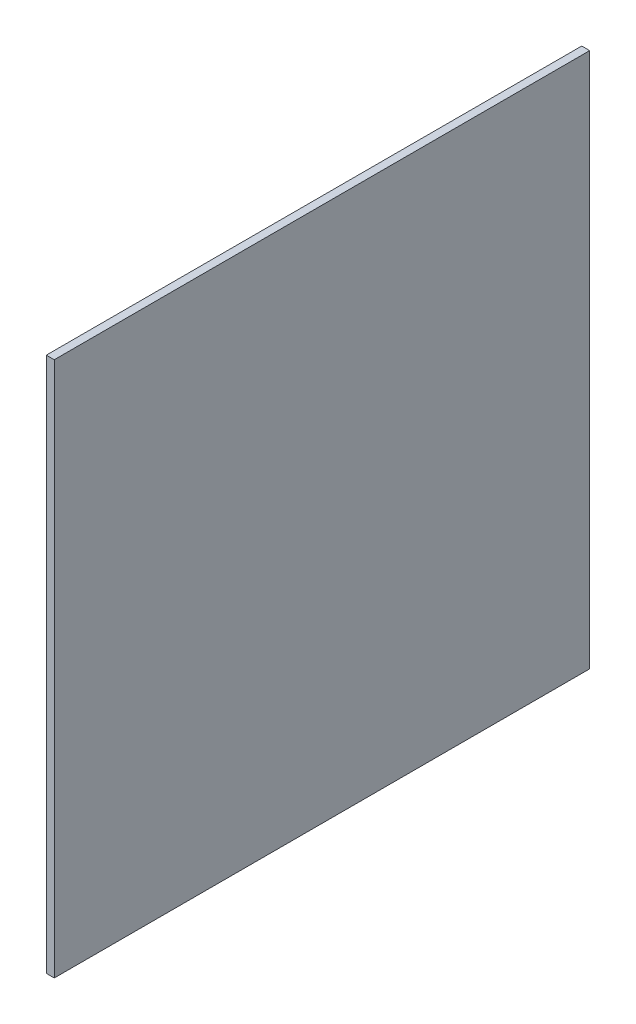
ISO-10303-21;
HEADER;
FILE_DESCRIPTION(('STEP AP214'),'2;1');
FILE_NAME('part.step','',(''),(''),'','','');
FILE_SCHEMA(('AUTOMOTIVE_DESIGN { 1 0 10303 214 1 1 1 1 }'));
ENDSEC;
DATA;
#1=APPLICATION_CONTEXT('core data for automotive mechanical design processes');
#2=APPLICATION_PROTOCOL_DEFINITION('international standard','automotive_design',2000,#1);
#3=PRODUCT_CONTEXT('',#1,'mechanical');
#4=PRODUCT('Part','Part','',(#3));
#5=PRODUCT_RELATED_PRODUCT_CATEGORY('part','',(#4));
#6=PRODUCT_DEFINITION_FORMATION('','',#4);
#7=PRODUCT_DEFINITION_CONTEXT('part definition',#1,'design');
#8=PRODUCT_DEFINITION('design','',#6,#7);
#9=PRODUCT_DEFINITION_SHAPE('','',#8);
#10=(LENGTH_UNIT() NAMED_UNIT(*) SI_UNIT(.MILLI.,.METRE.));
#11=(NAMED_UNIT(*) PLANE_ANGLE_UNIT() SI_UNIT($,.RADIAN.));
#12=(NAMED_UNIT(*) SI_UNIT($,.STERADIAN.) SOLID_ANGLE_UNIT());
#13=UNCERTAINTY_MEASURE_WITH_UNIT(LENGTH_MEASURE(1.E-05),#10,'distance_accuracy_value','');
#14=(GEOMETRIC_REPRESENTATION_CONTEXT(3) GLOBAL_UNCERTAINTY_ASSIGNED_CONTEXT((#13)) GLOBAL_UNIT_ASSIGNED_CONTEXT((#10,
#11,#12)) REPRESENTATION_CONTEXT('',''));
#15=CARTESIAN_POINT('',(0.,0.,0.));
#16=DIRECTION('',(0.,0.,1.));
#17=DIRECTION('',(1.,0.,0.));
#18=AXIS2_PLACEMENT_3D('',#15,#16,#17);
#19=CARTESIAN_POINT('',(-149.372067252863,-49.3069822605414,348.329360748642));
#20=DIRECTION('',(0.,0.,1.));
#21=DIRECTION('',(1.,0.,0.));
#22=AXIS2_PLACEMENT_3D('',#19,#20,#21);
#23=PLANE('',#22);
#24=DIRECTION('',(0.,1.,0.));
#25=VECTOR('',#24,1.);
#26=CARTESIAN_POINT('',(-150.808207914498,-49.3069822605414,348.329360748642));
#27=LINE('',#26,#25);
#28=CARTESIAN_POINT('',(-150.808207914498,-49.3069822605414,348.329360748642));
#29=VERTEX_POINT('',#28);
#30=CARTESIAN_POINT('',(-150.808207914498,47.35173923672,348.329360748642));
#31=VERTEX_POINT('',#30);
#32=EDGE_CURVE('E80',#29,#31,#27,.T.);
#33=ORIENTED_EDGE('',*,*,#32,.F.);
#34=DIRECTION('',(-1.,0.,0.));
#35=VECTOR('',#34,1.);
#36=CARTESIAN_POINT('',(-149.372067252863,-49.3069822605414,348.329360748642));
#37=LINE('',#36,#35);
#38=CARTESIAN_POINT('',(-149.372067252863,-49.3069822605414,348.329360748642));
#39=VERTEX_POINT('',#38);
#40=EDGE_CURVE('E33',#39,#29,#37,.T.);
#41=ORIENTED_EDGE('',*,*,#40,.F.);
#42=DIRECTION('',(0.,1.,0.));
#43=VECTOR('',#42,1.);
#44=CARTESIAN_POINT('',(-149.372067252863,-49.3069822605414,348.329360748642));
#45=LINE('',#44,#43);
#46=CARTESIAN_POINT('',(-149.372067252863,47.35173923672,348.329360748642));
#47=VERTEX_POINT('',#46);
#48=EDGE_CURVE('E72',#39,#47,#45,.T.);
#49=ORIENTED_EDGE('',*,*,#48,.T.);
#50=DIRECTION('',(-1.,0.,0.));
#51=VECTOR('',#50,1.);
#52=CARTESIAN_POINT('',(-149.372067252863,47.35173923672,348.329360748642));
#53=LINE('',#52,#51);
#54=EDGE_CURVE('E11',#47,#31,#53,.T.);
#55=ORIENTED_EDGE('',*,*,#54,.T.);
#56=EDGE_LOOP('',(#33,#41,#49,#55));
#57=FACE_BOUND('',#56,.T.);
#58=ADVANCED_FACE('F17',(#57),#23,.T.);
#59=CARTESIAN_POINT('',(-149.372067252863,47.35173923672,348.329360748642));
#60=DIRECTION('',(0.,1.,0.));
#61=DIRECTION('',(0.,0.,1.));
#62=AXIS2_PLACEMENT_3D('',#59,#60,#61);
#63=PLANE('',#62);
#64=DIRECTION('',(0.,0.,-1.));
#65=VECTOR('',#64,1.);
#66=CARTESIAN_POINT('',(-150.808207914498,47.35173923672,348.329360748642));
#67=LINE('',#66,#65);
#68=CARTESIAN_POINT('',(-150.808207914498,47.35173923672,251.670639251381));
#69=VERTEX_POINT('',#68);
#70=EDGE_CURVE('E83',#31,#69,#67,.T.);
#71=ORIENTED_EDGE('',*,*,#70,.F.);
#72=ORIENTED_EDGE('',*,*,#54,.F.);
#73=DIRECTION('',(0.,0.,-1.));
#74=VECTOR('',#73,1.);
#75=CARTESIAN_POINT('',(-149.372067252863,47.35173923672,348.329360748642));
#76=LINE('',#75,#74);
#77=CARTESIAN_POINT('',(-149.372067252863,47.35173923672,251.670639251381));
#78=VERTEX_POINT('',#77);
#79=EDGE_CURVE('E68',#47,#78,#76,.T.);
#80=ORIENTED_EDGE('',*,*,#79,.T.);
#81=DIRECTION('',(-1.,0.,0.));
#82=VECTOR('',#81,1.);
#83=CARTESIAN_POINT('',(-149.372067252863,47.35173923672,251.670639251381));
#84=LINE('',#83,#82);
#85=EDGE_CURVE('E25',#78,#69,#84,.T.);
#86=ORIENTED_EDGE('',*,*,#85,.T.);
#87=EDGE_LOOP('',(#71,#72,#80,#86));
#88=FACE_BOUND('',#87,.T.);
#89=ADVANCED_FACE('F69',(#88),#63,.T.);
#90=CARTESIAN_POINT('',(-149.372067252863,47.35173923672,251.670639251381));
#91=DIRECTION('',(0.,0.,-1.));
#92=DIRECTION('',(-1.,0.,0.));
#93=AXIS2_PLACEMENT_3D('',#90,#91,#92);
#94=PLANE('',#93);
#95=DIRECTION('',(0.,-1.,0.));
#96=VECTOR('',#95,1.);
#97=CARTESIAN_POINT('',(-150.808207914498,47.35173923672,251.670639251381));
#98=LINE('',#97,#96);
#99=CARTESIAN_POINT('',(-150.808207914498,-49.3069822605414,251.670639251381));
#100=VERTEX_POINT('',#99);
#101=EDGE_CURVE('E66',#69,#100,#98,.T.);
#102=ORIENTED_EDGE('',*,*,#101,.F.);
#103=ORIENTED_EDGE('',*,*,#85,.F.);
#104=DIRECTION('',(0.,-1.,0.));
#105=VECTOR('',#104,1.);
#106=CARTESIAN_POINT('',(-149.372067252863,47.35173923672,251.670639251381));
#107=LINE('',#106,#105);
#108=CARTESIAN_POINT('',(-149.372067252863,-49.3069822605414,251.670639251381));
#109=VERTEX_POINT('',#108);
#110=EDGE_CURVE('E63',#78,#109,#107,.T.);
#111=ORIENTED_EDGE('',*,*,#110,.T.);
#112=DIRECTION('',(-1.,0.,0.));
#113=VECTOR('',#112,1.);
#114=CARTESIAN_POINT('',(-149.372067252863,-49.3069822605414,251.670639251381));
#115=LINE('',#114,#113);
#116=EDGE_CURVE('E49',#109,#100,#115,.T.);
#117=ORIENTED_EDGE('',*,*,#116,.T.);
#118=EDGE_LOOP('',(#102,#103,#111,#117));
#119=FACE_BOUND('',#118,.T.);
#120=ADVANCED_FACE('F61',(#119),#94,.T.);
#121=CARTESIAN_POINT('',(-149.372067252863,-49.3069822605414,251.670639251381));
#122=DIRECTION('',(0.,-1.,0.));
#123=DIRECTION('',(0.,0.,-1.));
#124=AXIS2_PLACEMENT_3D('',#121,#122,#123);
#125=PLANE('',#124);
#126=DIRECTION('',(0.,0.,1.));
#127=VECTOR('',#126,1.);
#128=CARTESIAN_POINT('',(-150.808207914498,-49.3069822605414,251.670639251381));
#129=LINE('',#128,#127);
#130=EDGE_CURVE('E86',#100,#29,#129,.T.);
#131=ORIENTED_EDGE('',*,*,#130,.F.);
#132=ORIENTED_EDGE('',*,*,#116,.F.);
#133=DIRECTION('',(0.,0.,1.));
#134=VECTOR('',#133,1.);
#135=CARTESIAN_POINT('',(-149.372067252863,-49.3069822605414,251.670639251381));
#136=LINE('',#135,#134);
#137=EDGE_CURVE('E75',#109,#39,#136,.T.);
#138=ORIENTED_EDGE('',*,*,#137,.T.);
#139=ORIENTED_EDGE('',*,*,#40,.T.);
#140=EDGE_LOOP('',(#131,#132,#138,#139));
#141=FACE_BOUND('',#140,.T.);
#142=ADVANCED_FACE('F98',(#141),#125,.T.);
#143=CARTESIAN_POINT('',(-149.372067252863,-0.977621511910692,253.000000000011));
#144=DIRECTION('',(-1.,0.,0.));
#145=DIRECTION('',(0.,-1.,0.));
#146=AXIS2_PLACEMENT_3D('',#143,#144,#145);
#147=PLANE('',#146);
#148=ORIENTED_EDGE('',*,*,#48,.F.);
#149=ORIENTED_EDGE('',*,*,#137,.F.);
#150=ORIENTED_EDGE('',*,*,#110,.F.);
#151=ORIENTED_EDGE('',*,*,#79,.F.);
#152=EDGE_LOOP('',(#148,#149,#150,#151));
#153=FACE_BOUND('',#152,.T.);
#154=ADVANCED_FACE('F74',(#153),#147,.F.);
#155=CARTESIAN_POINT('',(-150.808207914498,-0.977621511910692,253.000000000011));
#156=DIRECTION('',(-1.,0.,0.));
#157=DIRECTION('',(0.,-1.,0.));
#158=AXIS2_PLACEMENT_3D('',#155,#156,#157);
#159=PLANE('',#158);
#160=ORIENTED_EDGE('',*,*,#32,.T.);
#161=ORIENTED_EDGE('',*,*,#70,.T.);
#162=ORIENTED_EDGE('',*,*,#101,.T.);
#163=ORIENTED_EDGE('',*,*,#130,.T.);
#164=EDGE_LOOP('',(#160,#161,#162,#163));
#165=FACE_BOUND('',#164,.T.);
#166=ADVANCED_FACE('F90',(#165),#159,.T.);
#167=CLOSED_SHELL('',(#58,#89,#120,#142,#154,#166));
#168=MANIFOLD_SOLID_BREP('B1',#167);
#169=ADVANCED_BREP_SHAPE_REPRESENTATION('',(#18,#168),#14);
#170=SHAPE_DEFINITION_REPRESENTATION(#9,#169);
ENDSEC;
END-ISO-10303-21;
